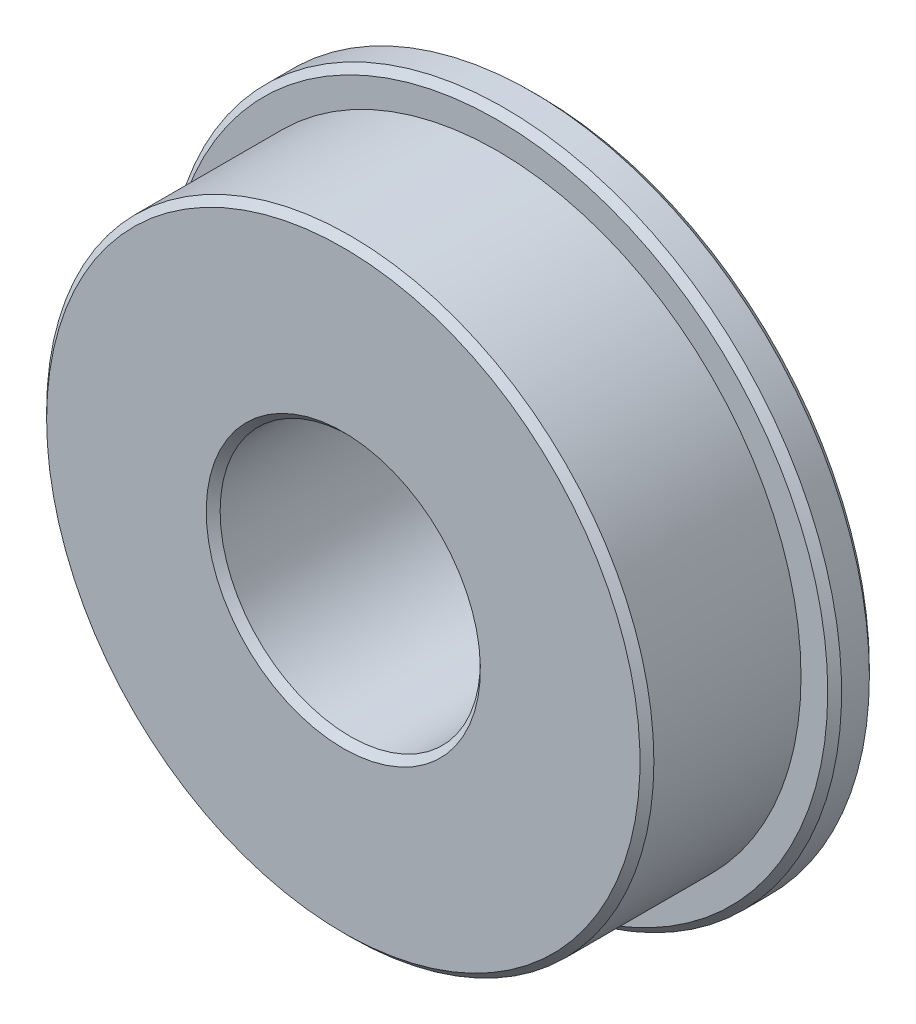
ISO-10303-21;
HEADER;
FILE_DESCRIPTION(('STEP AP214'),'2;1');
FILE_NAME('part.step','',(''),(''),'','','');
FILE_SCHEMA(('AUTOMOTIVE_DESIGN { 1 0 10303 214 1 1 1 1 }'));
ENDSEC;
DATA;
#1=APPLICATION_CONTEXT('core data for automotive mechanical design processes');
#2=APPLICATION_PROTOCOL_DEFINITION('international standard','automotive_design',2000,#1);
#3=PRODUCT_CONTEXT('',#1,'mechanical');
#4=PRODUCT('Part','Part','',(#3));
#5=PRODUCT_RELATED_PRODUCT_CATEGORY('part','',(#4));
#6=PRODUCT_DEFINITION_FORMATION('','',#4);
#7=PRODUCT_DEFINITION_CONTEXT('part definition',#1,'design');
#8=PRODUCT_DEFINITION('design','',#6,#7);
#9=PRODUCT_DEFINITION_SHAPE('','',#8);
#10=(LENGTH_UNIT() NAMED_UNIT(*) SI_UNIT(.MILLI.,.METRE.));
#11=(NAMED_UNIT(*) PLANE_ANGLE_UNIT() SI_UNIT($,.RADIAN.));
#12=(NAMED_UNIT(*) SI_UNIT($,.STERADIAN.) SOLID_ANGLE_UNIT());
#13=UNCERTAINTY_MEASURE_WITH_UNIT(LENGTH_MEASURE(1.E-05),#10,'distance_accuracy_value','');
#14=(GEOMETRIC_REPRESENTATION_CONTEXT(3) GLOBAL_UNCERTAINTY_ASSIGNED_CONTEXT((#13)) GLOBAL_UNIT_ASSIGNED_CONTEXT((#10,
#11,#12)) REPRESENTATION_CONTEXT('',''));
#15=CARTESIAN_POINT('',(0.,0.,0.));
#16=DIRECTION('',(0.,0.,1.));
#17=DIRECTION('',(1.,0.,0.));
#18=AXIS2_PLACEMENT_3D('',#15,#16,#17);
#19=CARTESIAN_POINT('',(-8.86153846153846,6.04195804195805,6.90879999999998));
#20=DIRECTION('',(0.,0.,-1.));
#21=DIRECTION('',(-1.,0.,0.));
#22=AXIS2_PLACEMENT_3D('',#19,#20,#21);
#23=CONICAL_SURFACE('',#22,11.1125,0.785398163397452);
#24=CARTESIAN_POINT('',(-8.86153846153846,6.04195804195805,6.9088));
#25=DIRECTION('',(0.,0.,-1.));
#26=DIRECTION('',(-1.,0.,0.));
#27=AXIS2_PLACEMENT_3D('',#24,#25,#26);
#28=CIRCLE('',#27,11.1125);
#29=CARTESIAN_POINT('',(-19.9740384615385,6.04195804195805,6.9088));
#30=VERTEX_POINT('',#29);
#31=EDGE_CURVE('E43',#30,#30,#28,.T.);
#32=ORIENTED_EDGE('',*,*,#31,.F.);
#33=EDGE_LOOP('',(#32));
#34=FACE_BOUND('',#33,.T.);
#35=CARTESIAN_POINT('',(-8.86153846153846,6.04195804195805,7.16279999999998));
#36=DIRECTION('',(0.,0.,-1.));
#37=DIRECTION('',(-1.,0.,0.));
#38=AXIS2_PLACEMENT_3D('',#35,#36,#37);
#39=CIRCLE('',#38,10.8585);
#40=CARTESIAN_POINT('',(-19.7200384615385,6.04195804195805,7.16279999999998));
#41=VERTEX_POINT('',#40);
#42=EDGE_CURVE('E17',#41,#41,#39,.T.);
#43=ORIENTED_EDGE('',*,*,#42,.T.);
#44=EDGE_LOOP('',(#43));
#45=FACE_BOUND('',#44,.T.);
#46=ADVANCED_FACE('F14',(#34,#45),#23,.T.);
#47=CARTESIAN_POINT('',(-8.86153846153846,6.04195804195805,7.1628));
#48=DIRECTION('',(0.,0.,-1.));
#49=DIRECTION('',(-1.,0.,0.));
#50=AXIS2_PLACEMENT_3D('',#47,#48,#49);
#51=CYLINDRICAL_SURFACE('',#50,11.1125);
#52=CARTESIAN_POINT('',(-8.86153846153846,6.04195804195805,1.524));
#53=DIRECTION('',(0.,0.,-1.));
#54=DIRECTION('',(-1.,0.,0.));
#55=AXIS2_PLACEMENT_3D('',#52,#53,#54);
#56=CIRCLE('',#55,11.1125);
#57=CARTESIAN_POINT('',(-19.9740384615385,6.04195804195805,1.524));
#58=VERTEX_POINT('',#57);
#59=EDGE_CURVE('E38',#58,#58,#56,.F.);
#60=ORIENTED_EDGE('',*,*,#59,.T.);
#61=EDGE_LOOP('',(#60));
#62=FACE_BOUND('',#61,.T.);
#63=ORIENTED_EDGE('',*,*,#31,.T.);
#64=EDGE_LOOP('',(#63));
#65=FACE_BOUND('',#64,.T.);
#66=ADVANCED_FACE('F158',(#62,#65),#51,.T.);
#67=CARTESIAN_POINT('',(-8.86153846153846,6.04195804195805,7.1628));
#68=DIRECTION('',(0.,0.,-1.));
#69=DIRECTION('',(-1.,0.,0.));
#70=AXIS2_PLACEMENT_3D('',#67,#68,#69);
#71=PLANE('',#70);
#72=ORIENTED_EDGE('',*,*,#42,.F.);
#73=EDGE_LOOP('',(#72));
#74=FACE_BOUND('',#73,.T.);
#75=CARTESIAN_POINT('',(-8.86153846153846,6.04195804195805,7.1627999999464));
#76=DIRECTION('',(0.,0.,1.));
#77=DIRECTION('',(0.,-1.,0.));
#78=AXIS2_PLACEMENT_3D('',#75,#76,#77);
#79=CIRCLE('',#78,5.01650000001817);
#80=CARTESIAN_POINT('',(-8.86153846153846,1.02545804193988,7.1627999999464));
#81=VERTEX_POINT('',#80);
#82=EDGE_CURVE('E36',#81,#81,#79,.F.);
#83=ORIENTED_EDGE('',*,*,#82,.T.);
#84=EDGE_LOOP('',(#83));
#85=FACE_BOUND('',#84,.T.);
#86=ADVANCED_FACE('F148',(#74,#85),#71,.F.);
#87=CARTESIAN_POINT('',(-8.86153846153846,6.04195804195805,1.524));
#88=DIRECTION('',(0.,0.,-1.));
#89=DIRECTION('',(-1.,0.,0.));
#90=AXIS2_PLACEMENT_3D('',#87,#88,#89);
#91=PLANE('',#90);
#92=ORIENTED_EDGE('',*,*,#59,.F.);
#93=EDGE_LOOP('',(#92));
#94=FACE_BOUND('',#93,.T.);
#95=CARTESIAN_POINT('',(-8.86153846153846,6.04195804195805,1.52399999999998));
#96=DIRECTION('',(0.,0.,-1.));
#97=DIRECTION('',(-1.,0.,0.));
#98=AXIS2_PLACEMENT_3D('',#95,#96,#97);
#99=CIRCLE('',#98,12.0904);
#100=CARTESIAN_POINT('',(-20.9519384615385,6.04195804195805,1.52399999999998));
#101=VERTEX_POINT('',#100);
#102=EDGE_CURVE('E32',#101,#101,#99,.T.);
#103=ORIENTED_EDGE('',*,*,#102,.F.);
#104=EDGE_LOOP('',(#103));
#105=FACE_BOUND('',#104,.T.);
#106=ADVANCED_FACE('F138',(#94,#105),#91,.F.);
#107=CARTESIAN_POINT('',(-8.86153846153846,6.04195804195805,7.1627999999464));
#108=DIRECTION('',(0.,0.,1.));
#109=DIRECTION('',(0.,-1.,0.));
#110=AXIS2_PLACEMENT_3D('',#107,#108,#109);
#111=CONICAL_SURFACE('',#110,5.01650000001817,0.785398163397448);
#112=ORIENTED_EDGE('',*,*,#82,.F.);
#113=EDGE_LOOP('',(#112));
#114=FACE_BOUND('',#113,.T.);
#115=CARTESIAN_POINT('',(-8.86153846153846,6.04195804195805,6.9088));
#116=DIRECTION('',(0.,0.,-1.));
#117=DIRECTION('',(-1.,0.,0.));
#118=AXIS2_PLACEMENT_3D('',#115,#116,#117);
#119=CIRCLE('',#118,4.7625);
#120=CARTESIAN_POINT('',(-13.6240384615385,6.04195804195805,6.9088));
#121=VERTEX_POINT('',#120);
#122=EDGE_CURVE('E35',#121,#121,#119,.T.);
#123=ORIENTED_EDGE('',*,*,#122,.T.);
#124=EDGE_LOOP('',(#123));
#125=FACE_BOUND('',#124,.T.);
#126=ADVANCED_FACE('F128',(#114,#125),#111,.F.);
#127=CARTESIAN_POINT('',(-8.86153846153846,6.04195804195805,1.26999999999998));
#128=DIRECTION('',(0.,0.,-1.));
#129=DIRECTION('',(-1.,0.,0.));
#130=AXIS2_PLACEMENT_3D('',#127,#128,#129);
#131=CONICAL_SURFACE('',#130,12.3444,0.785398163397451);
#132=CARTESIAN_POINT('',(-8.86153846153846,6.04195804195805,1.27));
#133=DIRECTION('',(0.,0.,-1.));
#134=DIRECTION('',(-1.,0.,0.));
#135=AXIS2_PLACEMENT_3D('',#132,#133,#134);
#136=CIRCLE('',#135,12.3444);
#137=CARTESIAN_POINT('',(-21.2059384615385,6.04195804195805,1.27));
#138=VERTEX_POINT('',#137);
#139=EDGE_CURVE('E54',#138,#138,#136,.T.);
#140=ORIENTED_EDGE('',*,*,#139,.F.);
#141=EDGE_LOOP('',(#140));
#142=FACE_BOUND('',#141,.T.);
#143=ORIENTED_EDGE('',*,*,#102,.T.);
#144=EDGE_LOOP('',(#143));
#145=FACE_BOUND('',#144,.T.);
#146=ADVANCED_FACE('F84',(#142,#145),#131,.T.);
#147=CARTESIAN_POINT('',(-8.86153846153846,6.04195804195805,1.524));
#148=DIRECTION('',(0.,0.,-1.));
#149=DIRECTION('',(-1.,0.,0.));
#150=AXIS2_PLACEMENT_3D('',#147,#148,#149);
#151=CYLINDRICAL_SURFACE('',#150,4.7625);
#152=ORIENTED_EDGE('',*,*,#122,.F.);
#153=EDGE_LOOP('',(#152));
#154=FACE_BOUND('',#153,.T.);
#155=CARTESIAN_POINT('',(-8.86153846153846,6.04195804195805,0.253999999927146));
#156=DIRECTION('',(0.,0.,-1.));
#157=DIRECTION('',(-1.,0.,0.));
#158=AXIS2_PLACEMENT_3D('',#155,#156,#157);
#159=CIRCLE('',#158,4.76249999996227);
#160=CARTESIAN_POINT('',(-13.6240384615007,6.04195804195805,0.253999999927146));
#161=VERTEX_POINT('',#160);
#162=EDGE_CURVE('E59',#161,#161,#159,.T.);
#163=ORIENTED_EDGE('',*,*,#162,.T.);
#164=EDGE_LOOP('',(#163));
#165=FACE_BOUND('',#164,.T.);
#166=ADVANCED_FACE('F74',(#154,#165),#151,.F.);
#167=CARTESIAN_POINT('',(-8.86153846153846,6.04195804195805,1.524));
#168=DIRECTION('',(0.,0.,-1.));
#169=DIRECTION('',(-1.,0.,0.));
#170=AXIS2_PLACEMENT_3D('',#167,#168,#169);
#171=CYLINDRICAL_SURFACE('',#170,12.3444);
#172=ORIENTED_EDGE('',*,*,#139,.T.);
#173=EDGE_LOOP('',(#172));
#174=FACE_BOUND('',#173,.T.);
#175=CARTESIAN_POINT('',(-8.86153846153846,6.04195804195805,0.25400000000002));
#176=DIRECTION('',(0.,0.,1.));
#177=DIRECTION('',(1.,0.,0.));
#178=AXIS2_PLACEMENT_3D('',#175,#176,#177);
#179=CIRCLE('',#178,12.3444);
#180=CARTESIAN_POINT('',(3.48286153846156,6.04195804195805,0.25400000000002));
#181=VERTEX_POINT('',#180);
#182=EDGE_CURVE('E26',#181,#181,#179,.F.);
#183=ORIENTED_EDGE('',*,*,#182,.F.);
#184=EDGE_LOOP('',(#183));
#185=FACE_BOUND('',#184,.T.);
#186=ADVANCED_FACE('F71',(#174,#185),#171,.T.);
#187=CARTESIAN_POINT('',(-8.86153846153846,6.04195804195805,-1.13686837721616E-10));
#188=DIRECTION('',(0.,0.,-1.));
#189=DIRECTION('',(-1.,0.,0.));
#190=AXIS2_PLACEMENT_3D('',#187,#188,#189);
#191=CONICAL_SURFACE('',#190,5.01650000005995,0.785398163397448);
#192=ORIENTED_EDGE('',*,*,#162,.F.);
#193=EDGE_LOOP('',(#192));
#194=FACE_BOUND('',#193,.T.);
#195=CARTESIAN_POINT('',(-8.86153846153846,6.04195804195805,-5.6843418860808E-11));
#196=DIRECTION('',(0.,0.,-1.));
#197=DIRECTION('',(-1.,0.,0.));
#198=AXIS2_PLACEMENT_3D('',#195,#196,#197);
#199=CIRCLE('',#198,5.0165000000031);
#200=CARTESIAN_POINT('',(-13.8780384615416,6.04195804195805,-5.6843418860808E-11));
#201=VERTEX_POINT('',#200);
#202=EDGE_CURVE('E21',#201,#201,#199,.F.);
#203=ORIENTED_EDGE('',*,*,#202,.F.);
#204=EDGE_LOOP('',(#203));
#205=FACE_BOUND('',#204,.T.);
#206=ADVANCED_FACE('F73',(#194,#205),#191,.F.);
#207=CARTESIAN_POINT('',(-8.86153846153846,6.04195804195805,0.254000000000021));
#208=DIRECTION('',(0.,0.,1.));
#209=DIRECTION('',(1.,0.,0.));
#210=AXIS2_PLACEMENT_3D('',#207,#208,#209);
#211=CONICAL_SURFACE('',#210,12.3444,0.785398163397449);
#212=CARTESIAN_POINT('',(-8.86153846153846,6.04195804195805,0.));
#213=DIRECTION('',(0.,0.,1.));
#214=DIRECTION('',(1.,0.,0.));
#215=AXIS2_PLACEMENT_3D('',#212,#213,#214);
#216=CIRCLE('',#215,12.0904);
#217=CARTESIAN_POINT('',(3.22886153846156,6.04195804195805,0.));
#218=VERTEX_POINT('',#217);
#219=EDGE_CURVE('E10',#218,#218,#216,.F.);
#220=ORIENTED_EDGE('',*,*,#219,.F.);
#221=EDGE_LOOP('',(#220));
#222=FACE_BOUND('',#221,.T.);
#223=ORIENTED_EDGE('',*,*,#182,.T.);
#224=EDGE_LOOP('',(#223));
#225=FACE_BOUND('',#224,.T.);
#226=ADVANCED_FACE('F69',(#222,#225),#211,.T.);
#227=CARTESIAN_POINT('',(-8.86153846153846,6.04195804195805,0.));
#228=DIRECTION('',(0.,0.,-1.));
#229=DIRECTION('',(-1.,0.,0.));
#230=AXIS2_PLACEMENT_3D('',#227,#228,#229);
#231=PLANE('',#230);
#232=ORIENTED_EDGE('',*,*,#219,.T.);
#233=EDGE_LOOP('',(#232));
#234=FACE_BOUND('',#233,.T.);
#235=ORIENTED_EDGE('',*,*,#202,.T.);
#236=EDGE_LOOP('',(#235));
#237=FACE_BOUND('',#236,.T.);
#238=ADVANCED_FACE('F87',(#234,#237),#231,.T.);
#239=CLOSED_SHELL('',(#46,#66,#86,#106,#126,#146,#166,#186,#206,#226,#238));
#240=MANIFOLD_SOLID_BREP('B1',#239);
#241=ADVANCED_BREP_SHAPE_REPRESENTATION('',(#18,#240),#14);
#242=SHAPE_DEFINITION_REPRESENTATION(#9,#241);
ENDSEC;
END-ISO-10303-21;
